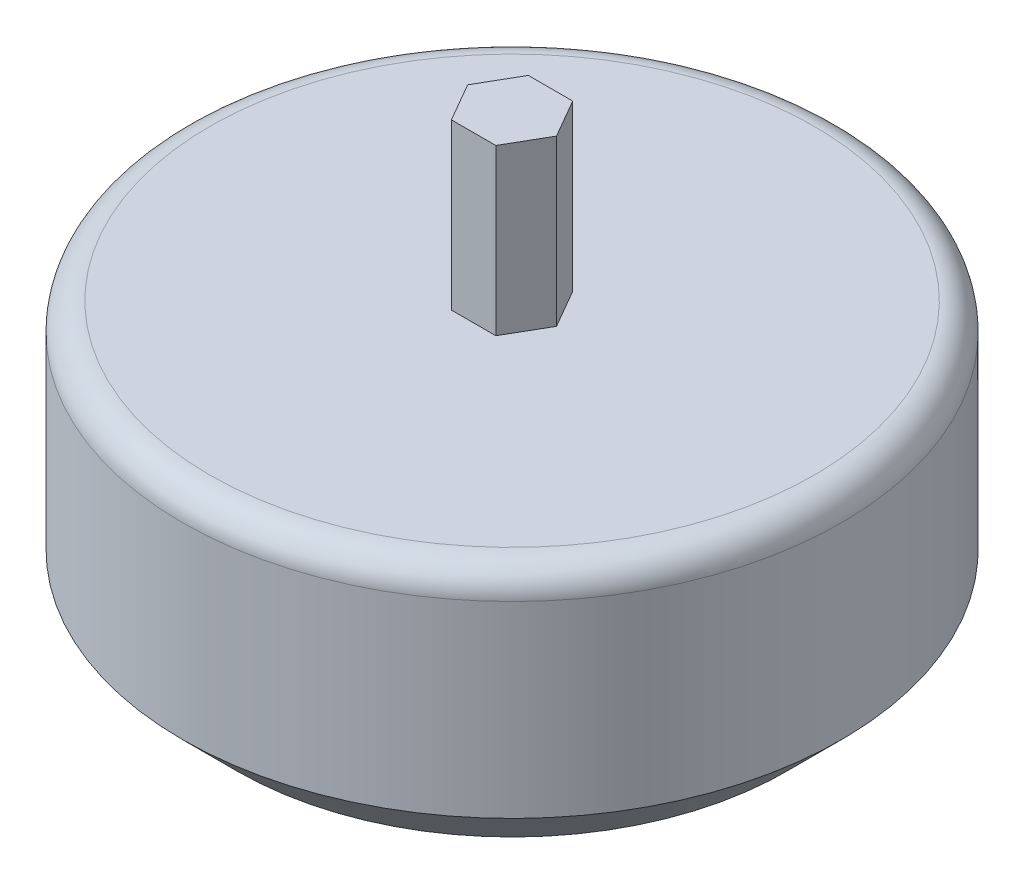
ISO-10303-21;
HEADER;
FILE_DESCRIPTION(('STEP AP214'),'2;1');
FILE_NAME('part.step','',(''),(''),'','','');
FILE_SCHEMA(('AUTOMOTIVE_DESIGN { 1 0 10303 214 1 1 1 1 }'));
ENDSEC;
DATA;
#1=APPLICATION_CONTEXT('core data for automotive mechanical design processes');
#2=APPLICATION_PROTOCOL_DEFINITION('international standard','automotive_design',2000,#1);
#3=PRODUCT_CONTEXT('',#1,'mechanical');
#4=PRODUCT('Part','Part','',(#3));
#5=PRODUCT_RELATED_PRODUCT_CATEGORY('part','',(#4));
#6=PRODUCT_DEFINITION_FORMATION('','',#4);
#7=PRODUCT_DEFINITION_CONTEXT('part definition',#1,'design');
#8=PRODUCT_DEFINITION('design','',#6,#7);
#9=PRODUCT_DEFINITION_SHAPE('','',#8);
#10=(LENGTH_UNIT() NAMED_UNIT(*) SI_UNIT(.MILLI.,.METRE.));
#11=(NAMED_UNIT(*) PLANE_ANGLE_UNIT() SI_UNIT($,.RADIAN.));
#12=(NAMED_UNIT(*) SI_UNIT($,.STERADIAN.) SOLID_ANGLE_UNIT());
#13=UNCERTAINTY_MEASURE_WITH_UNIT(LENGTH_MEASURE(1.E-05),#10,'distance_accuracy_value','');
#14=(GEOMETRIC_REPRESENTATION_CONTEXT(3) GLOBAL_UNCERTAINTY_ASSIGNED_CONTEXT((#13)) GLOBAL_UNIT_ASSIGNED_CONTEXT((#10,
#11,#12)) REPRESENTATION_CONTEXT('',''));
#15=CARTESIAN_POINT('',(0.,0.,0.));
#16=DIRECTION('',(0.,0.,1.));
#17=DIRECTION('',(1.,0.,0.));
#18=AXIS2_PLACEMENT_3D('',#15,#16,#17);
#19=CARTESIAN_POINT('',(0.,49.2,0.));
#20=DIRECTION('',(0.,1.,0.));
#21=DIRECTION('',(0.,0.,1.));
#22=AXIS2_PLACEMENT_3D('',#19,#20,#21);
#23=PLANE('',#22);
#24=CARTESIAN_POINT('',(0.,49.2,0.));
#25=DIRECTION('',(0.,1.,0.));
#26=DIRECTION('',(0.,0.,1.));
#27=AXIS2_PLACEMENT_3D('',#24,#25,#26);
#28=CIRCLE('',#27,55.);
#29=CARTESIAN_POINT('',(0.,49.2,55.));
#30=VERTEX_POINT('',#29);
#31=EDGE_CURVE('E151',#30,#30,#28,.T.);
#32=ORIENTED_EDGE('',*,*,#31,.T.);
#33=EDGE_LOOP('',(#32));
#34=FACE_BOUND('',#33,.T.);
#35=DIRECTION('',(-0.5,0.,0.866025403784439));
#36=VECTOR('',#35,1.);
#37=CARTESIAN_POINT('',(-4.04145188432738,49.2,-7.00000000000001));
#38=LINE('',#37,#36);
#39=CARTESIAN_POINT('',(-4.04145188432738,49.2,-7.00000000000001));
#40=VERTEX_POINT('',#39);
#41=CARTESIAN_POINT('',(-8.08290376865475,49.2,0.));
#42=VERTEX_POINT('',#41);
#43=EDGE_CURVE('E133',#40,#42,#38,.T.);
#44=ORIENTED_EDGE('',*,*,#43,.F.);
#45=DIRECTION('',(-1.,0.,0.));
#46=VECTOR('',#45,1.);
#47=CARTESIAN_POINT('',(4.0414518843274,49.2,-7.00000000000001));
#48=LINE('',#47,#46);
#49=CARTESIAN_POINT('',(4.0414518843274,49.2,-7.00000000000001));
#50=VERTEX_POINT('',#49);
#51=EDGE_CURVE('E130',#50,#40,#48,.T.);
#52=ORIENTED_EDGE('',*,*,#51,.F.);
#53=DIRECTION('',(-0.5,0.,-0.866025403784439));
#54=VECTOR('',#53,1.);
#55=CARTESIAN_POINT('',(8.08290376865478,49.2,0.));
#56=LINE('',#55,#54);
#57=CARTESIAN_POINT('',(8.08290376865478,49.2,0.));
#58=VERTEX_POINT('',#57);
#59=EDGE_CURVE('E87',#58,#50,#56,.T.);
#60=ORIENTED_EDGE('',*,*,#59,.F.);
#61=DIRECTION('',(0.500000000000001,0.,-0.866025403784438));
#62=VECTOR('',#61,1.);
#63=CARTESIAN_POINT('',(4.04145188432739,49.2,7.00000000000003));
#64=LINE('',#63,#62);
#65=CARTESIAN_POINT('',(4.04145188432739,49.2,7.00000000000003));
#66=VERTEX_POINT('',#65);
#67=EDGE_CURVE('E139',#66,#58,#64,.T.);
#68=ORIENTED_EDGE('',*,*,#67,.F.);
#69=DIRECTION('',(1.,0.,0.));
#70=VECTOR('',#69,1.);
#71=CARTESIAN_POINT('',(-4.04145188432736,49.2,7.00000000000003));
#72=LINE('',#71,#70);
#73=CARTESIAN_POINT('',(-4.04145188432736,49.2,7.00000000000003));
#74=VERTEX_POINT('',#73);
#75=EDGE_CURVE('E119',#74,#66,#72,.T.);
#76=ORIENTED_EDGE('',*,*,#75,.F.);
#77=DIRECTION('',(0.5,0.,0.866025403784439));
#78=VECTOR('',#77,1.);
#79=CARTESIAN_POINT('',(-8.08290376865475,49.2,0.));
#80=LINE('',#79,#78);
#81=EDGE_CURVE('E136',#42,#74,#80,.T.);
#82=ORIENTED_EDGE('',*,*,#81,.F.);
#83=EDGE_LOOP('',(#44,#52,#60,#68,#76,#82));
#84=FACE_BOUND('',#83,.T.);
#85=ADVANCED_FACE('F42',(#34,#84),#23,.T.);
#86=CARTESIAN_POINT('',(0.,49.2,0.));
#87=DIRECTION('',(0.,-1.,0.));
#88=DIRECTION('',(0.,0.,-1.));
#89=AXIS2_PLACEMENT_3D('',#86,#87,#88);
#90=CYLINDRICAL_SURFACE('',#89,60.);
#91=CARTESIAN_POINT('',(0.,10.,0.));
#92=DIRECTION('',(0.,1.,0.));
#93=DIRECTION('',(0.,0.,1.));
#94=AXIS2_PLACEMENT_3D('',#91,#92,#93);
#95=CIRCLE('',#94,60.);
#96=CARTESIAN_POINT('',(0.,10.,60.));
#97=VERTEX_POINT('',#96);
#98=EDGE_CURVE('E51',#97,#97,#95,.T.);
#99=ORIENTED_EDGE('',*,*,#98,.T.);
#100=EDGE_LOOP('',(#99));
#101=FACE_BOUND('',#100,.T.);
#102=CARTESIAN_POINT('',(0.,44.2,0.));
#103=DIRECTION('',(0.,1.,0.));
#104=DIRECTION('',(0.,0.,1.));
#105=AXIS2_PLACEMENT_3D('',#102,#103,#104);
#106=CIRCLE('',#105,60.);
#107=CARTESIAN_POINT('',(0.,44.2,60.));
#108=VERTEX_POINT('',#107);
#109=EDGE_CURVE('E154',#108,#108,#106,.F.);
#110=ORIENTED_EDGE('',*,*,#109,.T.);
#111=EDGE_LOOP('',(#110));
#112=FACE_BOUND('',#111,.T.);
#113=ADVANCED_FACE('F159',(#101,#112),#90,.T.);
#114=CARTESIAN_POINT('',(0.,0.,0.));
#115=DIRECTION('',(0.,1.,0.));
#116=DIRECTION('',(0.,0.,1.));
#117=AXIS2_PLACEMENT_3D('',#114,#115,#116);
#118=PLANE('',#117);
#119=CARTESIAN_POINT('',(0.,0.,0.));
#120=DIRECTION('',(0.,1.,0.));
#121=DIRECTION('',(0.,0.,1.));
#122=AXIS2_PLACEMENT_3D('',#119,#120,#121);
#123=CIRCLE('',#122,50.);
#124=CARTESIAN_POINT('',(0.,0.,50.));
#125=VERTEX_POINT('',#124);
#126=EDGE_CURVE('E11',#125,#125,#123,.F.);
#127=ORIENTED_EDGE('',*,*,#126,.T.);
#128=EDGE_LOOP('',(#127));
#129=FACE_BOUND('',#128,.T.);
#130=CARTESIAN_POINT('',(18.,0.,-31.1769145362398));
#131=DIRECTION('',(0.,-1.,0.));
#132=DIRECTION('',(0.,0.,-1.));
#133=AXIS2_PLACEMENT_3D('',#130,#131,#132);
#134=CIRCLE('',#133,2.1);
#135=CARTESIAN_POINT('',(18.,0.,-33.2769145362398));
#136=VERTEX_POINT('',#135);
#137=EDGE_CURVE('E250',#136,#136,#134,.T.);
#138=ORIENTED_EDGE('',*,*,#137,.F.);
#139=EDGE_LOOP('',(#138));
#140=FACE_BOUND('',#139,.T.);
#141=CARTESIAN_POINT('',(-18.,0.,-31.1769145362398));
#142=DIRECTION('',(0.,-1.,0.));
#143=DIRECTION('',(0.,0.,-1.));
#144=AXIS2_PLACEMENT_3D('',#141,#142,#143);
#145=CIRCLE('',#144,2.1);
#146=CARTESIAN_POINT('',(-18.,0.,-33.2769145362398));
#147=VERTEX_POINT('',#146);
#148=EDGE_CURVE('E244',#147,#147,#145,.T.);
#149=ORIENTED_EDGE('',*,*,#148,.F.);
#150=EDGE_LOOP('',(#149));
#151=FACE_BOUND('',#150,.T.);
#152=CARTESIAN_POINT('',(-18.,0.,31.1769145362398));
#153=DIRECTION('',(0.,-1.,0.));
#154=DIRECTION('',(0.,0.,-1.));
#155=AXIS2_PLACEMENT_3D('',#152,#153,#154);
#156=CIRCLE('',#155,2.1);
#157=CARTESIAN_POINT('',(-18.,0.,29.0769145362398));
#158=VERTEX_POINT('',#157);
#159=EDGE_CURVE('E238',#158,#158,#156,.T.);
#160=ORIENTED_EDGE('',*,*,#159,.F.);
#161=EDGE_LOOP('',(#160));
#162=FACE_BOUND('',#161,.T.);
#163=CARTESIAN_POINT('',(18.,0.,31.1769145362398));
#164=DIRECTION('',(0.,-1.,0.));
#165=DIRECTION('',(0.,0.,-1.));
#166=AXIS2_PLACEMENT_3D('',#163,#164,#165);
#167=CIRCLE('',#166,2.1);
#168=CARTESIAN_POINT('',(18.,0.,29.0769145362398));
#169=VERTEX_POINT('',#168);
#170=EDGE_CURVE('E232',#169,#169,#167,.T.);
#171=ORIENTED_EDGE('',*,*,#170,.F.);
#172=EDGE_LOOP('',(#171));
#173=FACE_BOUND('',#172,.T.);
#174=ADVANCED_FACE('F178',(#129,#140,#151,#162,#173),#118,.F.);
#175=CARTESIAN_POINT('',(4.0414518843274,79.2,-7.00000000000001));
#176=DIRECTION('',(0.,0.,1.));
#177=DIRECTION('',(1.,0.,0.));
#178=AXIS2_PLACEMENT_3D('',#175,#176,#177);
#179=PLANE('',#178);
#180=ORIENTED_EDGE('',*,*,#51,.T.);
#181=DIRECTION('',(0.,-1.,0.));
#182=VECTOR('',#181,1.);
#183=CARTESIAN_POINT('',(-4.04145188432738,79.2,-7.00000000000001));
#184=LINE('',#183,#182);
#185=CARTESIAN_POINT('',(-4.04145188432738,79.2,-7.00000000000001));
#186=VERTEX_POINT('',#185);
#187=EDGE_CURVE('E149',#186,#40,#184,.T.);
#188=ORIENTED_EDGE('',*,*,#187,.F.);
#189=DIRECTION('',(-1.,0.,0.));
#190=VECTOR('',#189,1.);
#191=CARTESIAN_POINT('',(4.0414518843274,79.2,-7.00000000000001));
#192=LINE('',#191,#190);
#193=CARTESIAN_POINT('',(4.0414518843274,79.2,-7.00000000000001));
#194=VERTEX_POINT('',#193);
#195=EDGE_CURVE('E142',#194,#186,#192,.T.);
#196=ORIENTED_EDGE('',*,*,#195,.F.);
#197=DIRECTION('',(0.,-1.,0.));
#198=VECTOR('',#197,1.);
#199=CARTESIAN_POINT('',(4.0414518843274,79.2,-7.00000000000001));
#200=LINE('',#199,#198);
#201=EDGE_CURVE('E126',#194,#50,#200,.T.);
#202=ORIENTED_EDGE('',*,*,#201,.T.);
#203=EDGE_LOOP('',(#180,#188,#196,#202));
#204=FACE_BOUND('',#203,.T.);
#205=ADVANCED_FACE('F183',(#204),#179,.F.);
#206=CARTESIAN_POINT('',(-4.04145188432738,79.2,-7.00000000000001));
#207=DIRECTION('',(0.866025403784439,0.,0.5));
#208=DIRECTION('',(0.5,0.,-0.866025403784439));
#209=AXIS2_PLACEMENT_3D('',#206,#207,#208);
#210=PLANE('',#209);
#211=ORIENTED_EDGE('',*,*,#43,.T.);
#212=DIRECTION('',(0.,-1.,0.));
#213=VECTOR('',#212,1.);
#214=CARTESIAN_POINT('',(-8.08290376865475,79.2,0.));
#215=LINE('',#214,#213);
#216=CARTESIAN_POINT('',(-8.08290376865475,79.2,0.));
#217=VERTEX_POINT('',#216);
#218=EDGE_CURVE('E146',#217,#42,#215,.T.);
#219=ORIENTED_EDGE('',*,*,#218,.F.);
#220=DIRECTION('',(-0.5,0.,0.866025403784439));
#221=VECTOR('',#220,1.);
#222=CARTESIAN_POINT('',(-4.04145188432738,79.2,-7.00000000000001));
#223=LINE('',#222,#221);
#224=EDGE_CURVE('E95',#186,#217,#223,.T.);
#225=ORIENTED_EDGE('',*,*,#224,.F.);
#226=ORIENTED_EDGE('',*,*,#187,.T.);
#227=EDGE_LOOP('',(#211,#219,#225,#226));
#228=FACE_BOUND('',#227,.T.);
#229=ADVANCED_FACE('F215',(#228),#210,.F.);
#230=CARTESIAN_POINT('',(-8.08290376865475,79.2,0.));
#231=DIRECTION('',(0.866025403784439,0.,-0.5));
#232=DIRECTION('',(-0.5,0.,-0.866025403784439));
#233=AXIS2_PLACEMENT_3D('',#230,#231,#232);
#234=PLANE('',#233);
#235=ORIENTED_EDGE('',*,*,#81,.T.);
#236=DIRECTION('',(0.,-1.,0.));
#237=VECTOR('',#236,1.);
#238=CARTESIAN_POINT('',(-4.04145188432736,79.2,7.00000000000003));
#239=LINE('',#238,#237);
#240=CARTESIAN_POINT('',(-4.04145188432736,79.2,7.00000000000003));
#241=VERTEX_POINT('',#240);
#242=EDGE_CURVE('E122',#241,#74,#239,.T.);
#243=ORIENTED_EDGE('',*,*,#242,.F.);
#244=DIRECTION('',(0.5,0.,0.866025403784439));
#245=VECTOR('',#244,1.);
#246=CARTESIAN_POINT('',(-8.08290376865475,79.2,0.));
#247=LINE('',#246,#245);
#248=EDGE_CURVE('E110',#217,#241,#247,.T.);
#249=ORIENTED_EDGE('',*,*,#248,.F.);
#250=ORIENTED_EDGE('',*,*,#218,.T.);
#251=EDGE_LOOP('',(#235,#243,#249,#250));
#252=FACE_BOUND('',#251,.T.);
#253=ADVANCED_FACE('F213',(#252),#234,.F.);
#254=CARTESIAN_POINT('',(-4.04145188432736,79.2,7.00000000000003));
#255=DIRECTION('',(0.,0.,-1.));
#256=DIRECTION('',(-1.,0.,0.));
#257=AXIS2_PLACEMENT_3D('',#254,#255,#256);
#258=PLANE('',#257);
#259=ORIENTED_EDGE('',*,*,#75,.T.);
#260=DIRECTION('',(0.,-1.,0.));
#261=VECTOR('',#260,1.);
#262=CARTESIAN_POINT('',(4.04145188432739,79.2,7.00000000000003));
#263=LINE('',#262,#261);
#264=CARTESIAN_POINT('',(4.04145188432739,79.2,7.00000000000003));
#265=VERTEX_POINT('',#264);
#266=EDGE_CURVE('E116',#265,#66,#263,.T.);
#267=ORIENTED_EDGE('',*,*,#266,.F.);
#268=DIRECTION('',(1.,0.,0.));
#269=VECTOR('',#268,1.);
#270=CARTESIAN_POINT('',(-4.04145188432736,79.2,7.00000000000003));
#271=LINE('',#270,#269);
#272=EDGE_CURVE('E104',#241,#265,#271,.T.);
#273=ORIENTED_EDGE('',*,*,#272,.F.);
#274=ORIENTED_EDGE('',*,*,#242,.T.);
#275=EDGE_LOOP('',(#259,#267,#273,#274));
#276=FACE_BOUND('',#275,.T.);
#277=ADVANCED_FACE('F117',(#276),#258,.F.);
#278=CARTESIAN_POINT('',(4.04145188432739,79.2,7.00000000000003));
#279=DIRECTION('',(-0.866025403784438,0.,-0.500000000000001));
#280=DIRECTION('',(-0.500000000000001,0.,0.866025403784438));
#281=AXIS2_PLACEMENT_3D('',#278,#279,#280);
#282=PLANE('',#281);
#283=ORIENTED_EDGE('',*,*,#67,.T.);
#284=DIRECTION('',(0.,-1.,0.));
#285=VECTOR('',#284,1.);
#286=CARTESIAN_POINT('',(8.08290376865478,79.2,0.));
#287=LINE('',#286,#285);
#288=CARTESIAN_POINT('',(8.08290376865478,79.2,0.));
#289=VERTEX_POINT('',#288);
#290=EDGE_CURVE('E58',#289,#58,#287,.T.);
#291=ORIENTED_EDGE('',*,*,#290,.F.);
#292=DIRECTION('',(0.500000000000001,0.,-0.866025403784438));
#293=VECTOR('',#292,1.);
#294=CARTESIAN_POINT('',(4.04145188432739,79.2,7.00000000000003));
#295=LINE('',#294,#293);
#296=EDGE_CURVE('E108',#265,#289,#295,.T.);
#297=ORIENTED_EDGE('',*,*,#296,.F.);
#298=ORIENTED_EDGE('',*,*,#266,.T.);
#299=EDGE_LOOP('',(#283,#291,#297,#298));
#300=FACE_BOUND('',#299,.T.);
#301=ADVANCED_FACE('F124',(#300),#282,.F.);
#302=CARTESIAN_POINT('',(8.08290376865478,79.2,0.));
#303=DIRECTION('',(-0.866025403784439,0.,0.5));
#304=DIRECTION('',(0.5,0.,0.866025403784439));
#305=AXIS2_PLACEMENT_3D('',#302,#303,#304);
#306=PLANE('',#305);
#307=ORIENTED_EDGE('',*,*,#59,.T.);
#308=ORIENTED_EDGE('',*,*,#201,.F.);
#309=DIRECTION('',(-0.5,0.,-0.866025403784439));
#310=VECTOR('',#309,1.);
#311=CARTESIAN_POINT('',(8.08290376865478,79.2,0.));
#312=LINE('',#311,#310);
#313=EDGE_CURVE('E66',#289,#194,#312,.T.);
#314=ORIENTED_EDGE('',*,*,#313,.F.);
#315=ORIENTED_EDGE('',*,*,#290,.T.);
#316=EDGE_LOOP('',(#307,#308,#314,#315));
#317=FACE_BOUND('',#316,.T.);
#318=ADVANCED_FACE('F198',(#317),#306,.F.);
#319=CARTESIAN_POINT('',(0.,79.2,0.));
#320=DIRECTION('',(0.,1.,0.));
#321=DIRECTION('',(0.,0.,1.));
#322=AXIS2_PLACEMENT_3D('',#319,#320,#321);
#323=PLANE('',#322);
#324=ORIENTED_EDGE('',*,*,#195,.T.);
#325=ORIENTED_EDGE('',*,*,#224,.T.);
#326=ORIENTED_EDGE('',*,*,#248,.T.);
#327=ORIENTED_EDGE('',*,*,#272,.T.);
#328=ORIENTED_EDGE('',*,*,#296,.T.);
#329=ORIENTED_EDGE('',*,*,#313,.T.);
#330=EDGE_LOOP('',(#324,#325,#326,#327,#328,#329));
#331=FACE_BOUND('',#330,.T.);
#332=ADVANCED_FACE('F106',(#331),#323,.T.);
#333=CARTESIAN_POINT('',(0.,44.2,0.));
#334=DIRECTION('',(0.,1.,0.));
#335=DIRECTION('',(0.,0.,1.));
#336=AXIS2_PLACEMENT_3D('',#333,#334,#335);
#337=TOROIDAL_SURFACE('',#336,55.,5.);
#338=ORIENTED_EDGE('',*,*,#109,.F.);
#339=EDGE_LOOP('',(#338));
#340=FACE_BOUND('',#339,.T.);
#341=ORIENTED_EDGE('',*,*,#31,.F.);
#342=EDGE_LOOP('',(#341));
#343=FACE_BOUND('',#342,.T.);
#344=ADVANCED_FACE('F187',(#340,#343),#337,.T.);
#345=CARTESIAN_POINT('',(18.,5.,31.1769145362398));
#346=DIRECTION('',(0.,-1.,0.));
#347=DIRECTION('',(0.,0.,-1.));
#348=AXIS2_PLACEMENT_3D('',#345,#346,#347);
#349=CONICAL_SURFACE('',#348,2.1,1.02974425867665);
#350=CARTESIAN_POINT('',(18.,6.26180729995788,31.1769145362398));
#351=VERTEX_POINT('',#350);
#352=VERTEX_LOOP('',#351);
#353=FACE_BOUND('',#352,.T.);
#354=CARTESIAN_POINT('',(18.,5.,31.1769145362398));
#355=DIRECTION('',(0.,-1.,0.));
#356=DIRECTION('',(0.,0.,-1.));
#357=AXIS2_PLACEMENT_3D('',#354,#355,#356);
#358=CIRCLE('',#357,2.1);
#359=CARTESIAN_POINT('',(18.,5.,29.0769145362398));
#360=VERTEX_POINT('',#359);
#361=EDGE_CURVE('E134',#360,#360,#358,.T.);
#362=ORIENTED_EDGE('',*,*,#361,.T.);
#363=EDGE_LOOP('',(#362));
#364=FACE_BOUND('',#363,.T.);
#365=ADVANCED_FACE('F189',(#353,#364),#349,.F.);
#366=CARTESIAN_POINT('',(18.,0.,31.1769145362398));
#367=DIRECTION('',(0.,-1.,0.));
#368=DIRECTION('',(0.,0.,-1.));
#369=AXIS2_PLACEMENT_3D('',#366,#367,#368);
#370=CYLINDRICAL_SURFACE('',#369,2.1);
#371=ORIENTED_EDGE('',*,*,#361,.F.);
#372=EDGE_LOOP('',(#371));
#373=FACE_BOUND('',#372,.T.);
#374=ORIENTED_EDGE('',*,*,#170,.T.);
#375=EDGE_LOOP('',(#374));
#376=FACE_BOUND('',#375,.T.);
#377=ADVANCED_FACE('F195',(#373,#376),#370,.F.);
#378=CARTESIAN_POINT('',(-18.,5.,31.1769145362398));
#379=DIRECTION('',(0.,-1.,0.));
#380=DIRECTION('',(0.,0.,-1.));
#381=AXIS2_PLACEMENT_3D('',#378,#379,#380);
#382=CONICAL_SURFACE('',#381,2.1,1.02974425867665);
#383=CARTESIAN_POINT('',(-18.,6.26180729995788,31.1769145362398));
#384=VERTEX_POINT('',#383);
#385=VERTEX_LOOP('',#384);
#386=FACE_BOUND('',#385,.T.);
#387=CARTESIAN_POINT('',(-18.,5.,31.1769145362398));
#388=DIRECTION('',(0.,-1.,0.));
#389=DIRECTION('',(0.,0.,-1.));
#390=AXIS2_PLACEMENT_3D('',#387,#388,#389);
#391=CIRCLE('',#390,2.1);
#392=CARTESIAN_POINT('',(-18.,5.,29.0769145362398));
#393=VERTEX_POINT('',#392);
#394=EDGE_CURVE('E235',#393,#393,#391,.T.);
#395=ORIENTED_EDGE('',*,*,#394,.T.);
#396=EDGE_LOOP('',(#395));
#397=FACE_BOUND('',#396,.T.);
#398=ADVANCED_FACE('F263',(#386,#397),#382,.F.);
#399=CARTESIAN_POINT('',(-18.,0.,31.1769145362398));
#400=DIRECTION('',(0.,-1.,0.));
#401=DIRECTION('',(0.,0.,-1.));
#402=AXIS2_PLACEMENT_3D('',#399,#400,#401);
#403=CYLINDRICAL_SURFACE('',#402,2.1);
#404=ORIENTED_EDGE('',*,*,#394,.F.);
#405=EDGE_LOOP('',(#404));
#406=FACE_BOUND('',#405,.T.);
#407=ORIENTED_EDGE('',*,*,#159,.T.);
#408=EDGE_LOOP('',(#407));
#409=FACE_BOUND('',#408,.T.);
#410=ADVANCED_FACE('F268',(#406,#409),#403,.F.);
#411=CARTESIAN_POINT('',(-18.,5.,-31.1769145362398));
#412=DIRECTION('',(0.,-1.,0.));
#413=DIRECTION('',(0.,0.,-1.));
#414=AXIS2_PLACEMENT_3D('',#411,#412,#413);
#415=CONICAL_SURFACE('',#414,2.1,1.02974425867665);
#416=CARTESIAN_POINT('',(-18.,6.26180729995788,-31.1769145362398));
#417=VERTEX_POINT('',#416);
#418=VERTEX_LOOP('',#417);
#419=FACE_BOUND('',#418,.T.);
#420=CARTESIAN_POINT('',(-18.,5.,-31.1769145362398));
#421=DIRECTION('',(0.,-1.,0.));
#422=DIRECTION('',(0.,0.,-1.));
#423=AXIS2_PLACEMENT_3D('',#420,#421,#422);
#424=CIRCLE('',#423,2.1);
#425=CARTESIAN_POINT('',(-18.,5.,-33.2769145362398));
#426=VERTEX_POINT('',#425);
#427=EDGE_CURVE('E241',#426,#426,#424,.T.);
#428=ORIENTED_EDGE('',*,*,#427,.T.);
#429=EDGE_LOOP('',(#428));
#430=FACE_BOUND('',#429,.T.);
#431=ADVANCED_FACE('F275',(#419,#430),#415,.F.);
#432=CARTESIAN_POINT('',(-18.,0.,-31.1769145362398));
#433=DIRECTION('',(0.,-1.,0.));
#434=DIRECTION('',(0.,0.,-1.));
#435=AXIS2_PLACEMENT_3D('',#432,#433,#434);
#436=CYLINDRICAL_SURFACE('',#435,2.1);
#437=ORIENTED_EDGE('',*,*,#427,.F.);
#438=EDGE_LOOP('',(#437));
#439=FACE_BOUND('',#438,.T.);
#440=ORIENTED_EDGE('',*,*,#148,.T.);
#441=EDGE_LOOP('',(#440));
#442=FACE_BOUND('',#441,.T.);
#443=ADVANCED_FACE('F279',(#439,#442),#436,.F.);
#444=CARTESIAN_POINT('',(18.,5.,-31.1769145362398));
#445=DIRECTION('',(0.,-1.,0.));
#446=DIRECTION('',(0.,0.,-1.));
#447=AXIS2_PLACEMENT_3D('',#444,#445,#446);
#448=CONICAL_SURFACE('',#447,2.1,1.02974425867665);
#449=CARTESIAN_POINT('',(18.,6.26180729995788,-31.1769145362398));
#450=VERTEX_POINT('',#449);
#451=VERTEX_LOOP('',#450);
#452=FACE_BOUND('',#451,.T.);
#453=CARTESIAN_POINT('',(18.,5.,-31.1769145362398));
#454=DIRECTION('',(0.,-1.,0.));
#455=DIRECTION('',(0.,0.,-1.));
#456=AXIS2_PLACEMENT_3D('',#453,#454,#455);
#457=CIRCLE('',#456,2.1);
#458=CARTESIAN_POINT('',(18.,5.,-33.2769145362398));
#459=VERTEX_POINT('',#458);
#460=EDGE_CURVE('E247',#459,#459,#457,.T.);
#461=ORIENTED_EDGE('',*,*,#460,.T.);
#462=EDGE_LOOP('',(#461));
#463=FACE_BOUND('',#462,.T.);
#464=ADVANCED_FACE('F168',(#452,#463),#448,.F.);
#465=CARTESIAN_POINT('',(18.,0.,-31.1769145362398));
#466=DIRECTION('',(0.,-1.,0.));
#467=DIRECTION('',(0.,0.,-1.));
#468=AXIS2_PLACEMENT_3D('',#465,#466,#467);
#469=CYLINDRICAL_SURFACE('',#468,2.1);
#470=ORIENTED_EDGE('',*,*,#460,.F.);
#471=EDGE_LOOP('',(#470));
#472=FACE_BOUND('',#471,.T.);
#473=ORIENTED_EDGE('',*,*,#137,.T.);
#474=EDGE_LOOP('',(#473));
#475=FACE_BOUND('',#474,.T.);
#476=ADVANCED_FACE('F163',(#472,#475),#469,.F.);
#477=CARTESIAN_POINT('',(0.,10.,0.));
#478=DIRECTION('',(0.,1.,0.));
#479=DIRECTION('',(0.,0.,1.));
#480=AXIS2_PLACEMENT_3D('',#477,#478,#479);
#481=CONICAL_SURFACE('',#480,60.,0.78539816339745);
#482=ORIENTED_EDGE('',*,*,#126,.F.);
#483=EDGE_LOOP('',(#482));
#484=FACE_BOUND('',#483,.T.);
#485=ORIENTED_EDGE('',*,*,#98,.F.);
#486=EDGE_LOOP('',(#485));
#487=FACE_BOUND('',#486,.T.);
#488=ADVANCED_FACE('F45',(#484,#487),#481,.T.);
#489=CLOSED_SHELL('',(#85,#113,#174,#205,#229,#253,#277,#301,#318,#332,#344,#365,#377,#398,#410,
#431,#443,#464,#476,#488));
#490=MANIFOLD_SOLID_BREP('B2',#489);
#491=ADVANCED_BREP_SHAPE_REPRESENTATION('',(#18,#490),#14);
#492=SHAPE_DEFINITION_REPRESENTATION(#9,#491);
ENDSEC;
END-ISO-10303-21;
